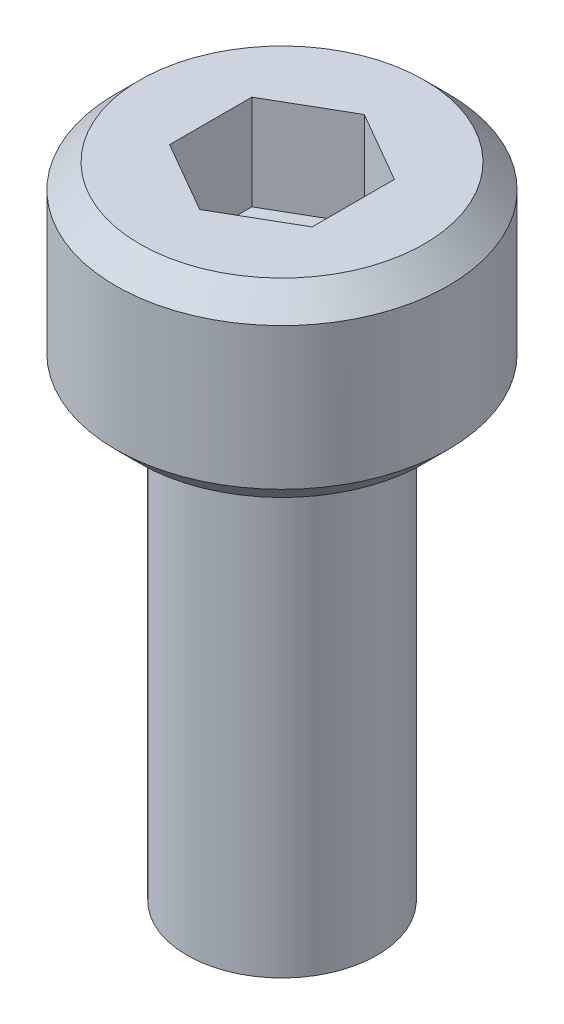
ISO-10303-21;
HEADER;
FILE_DESCRIPTION(('STEP AP214'),'2;1');
FILE_NAME('part.step','',(''),(''),'','','');
FILE_SCHEMA(('AUTOMOTIVE_DESIGN { 1 0 10303 214 1 1 1 1 }'));
ENDSEC;
DATA;
#1=APPLICATION_CONTEXT('core data for automotive mechanical design processes');
#2=APPLICATION_PROTOCOL_DEFINITION('international standard','automotive_design',2000,#1);
#3=PRODUCT_CONTEXT('',#1,'mechanical');
#4=PRODUCT('Part','Part','',(#3));
#5=PRODUCT_RELATED_PRODUCT_CATEGORY('part','',(#4));
#6=PRODUCT_DEFINITION_FORMATION('','',#4);
#7=PRODUCT_DEFINITION_CONTEXT('part definition',#1,'design');
#8=PRODUCT_DEFINITION('design','',#6,#7);
#9=PRODUCT_DEFINITION_SHAPE('','',#8);
#10=(LENGTH_UNIT() NAMED_UNIT(*) SI_UNIT(.MILLI.,.METRE.));
#11=(NAMED_UNIT(*) PLANE_ANGLE_UNIT() SI_UNIT($,.RADIAN.));
#12=(NAMED_UNIT(*) SI_UNIT($,.STERADIAN.) SOLID_ANGLE_UNIT());
#13=UNCERTAINTY_MEASURE_WITH_UNIT(LENGTH_MEASURE(1.E-05),#10,'distance_accuracy_value','');
#14=(GEOMETRIC_REPRESENTATION_CONTEXT(3) GLOBAL_UNCERTAINTY_ASSIGNED_CONTEXT((#13)) GLOBAL_UNIT_ASSIGNED_CONTEXT((#10,
#11,#12)) REPRESENTATION_CONTEXT('',''));
#15=CARTESIAN_POINT('',(0.,0.,0.));
#16=DIRECTION('',(0.,0.,1.));
#17=DIRECTION('',(1.,0.,0.));
#18=AXIS2_PLACEMENT_3D('',#15,#16,#17);
#19=CARTESIAN_POINT('',(0.,1.99999199999999,-1.73205080756887));
#20=DIRECTION('',(-0.5,0.,-0.866025403784439));
#21=DIRECTION('',(-0.866025403784439,0.,0.5));
#22=AXIS2_PLACEMENT_3D('',#19,#20,#21);
#23=PLANE('',#22);
#24=DIRECTION('',(0.,-1.,0.));
#25=VECTOR('',#24,1.);
#26=CARTESIAN_POINT('',(-1.49999999999999,1.99999199999999,-0.866025403784432));
#27=LINE('',#26,#25);
#28=CARTESIAN_POINT('',(-1.49999999999999,3.99999199999999,-0.866025403784429));
#29=VERTEX_POINT('',#28);
#30=CARTESIAN_POINT('',(-1.49999999999999,1.99999199999999,-0.866025403784429));
#31=VERTEX_POINT('',#30);
#32=EDGE_CURVE('E98',#29,#31,#27,.T.);
#33=ORIENTED_EDGE('',*,*,#32,.T.);
#34=DIRECTION('',(-0.866025403784439,0.,0.5));
#35=VECTOR('',#34,1.);
#36=CARTESIAN_POINT('',(0.,1.99999199999999,-1.73205080756887));
#37=LINE('',#36,#35);
#38=CARTESIAN_POINT('',(0.,1.999992,-1.73205080756887));
#39=VERTEX_POINT('',#38);
#40=EDGE_CURVE('E86',#39,#31,#37,.T.);
#41=ORIENTED_EDGE('',*,*,#40,.F.);
#42=DIRECTION('',(0.,1.,0.));
#43=VECTOR('',#42,1.);
#44=CARTESIAN_POINT('',(0.,1.99999200000003,-1.73205080756886));
#45=LINE('',#44,#43);
#46=CARTESIAN_POINT('',(0.,3.99999200000001,-1.73205080756887));
#47=VERTEX_POINT('',#46);
#48=EDGE_CURVE('E112',#39,#47,#45,.T.);
#49=ORIENTED_EDGE('',*,*,#48,.T.);
#50=DIRECTION('',(-0.866025403784439,0.,0.5));
#51=VECTOR('',#50,1.);
#52=CARTESIAN_POINT('',(0.,3.99999199999999,-1.73205080756887));
#53=LINE('',#52,#51);
#54=EDGE_CURVE('E80',#29,#47,#53,.F.);
#55=ORIENTED_EDGE('',*,*,#54,.F.);
#56=EDGE_LOOP('',(#33,#41,#49,#55));
#57=FACE_BOUND('',#56,.T.);
#58=ADVANCED_FACE('F17',(#57),#23,.F.);
#59=CARTESIAN_POINT('',(-1.49999999999999,1.99999199999999,-0.866025403784432));
#60=DIRECTION('',(-1.,0.,0.));
#61=DIRECTION('',(0.,-1.,0.));
#62=AXIS2_PLACEMENT_3D('',#59,#60,#61);
#63=PLANE('',#62);
#64=DIRECTION('',(0.,1.,0.));
#65=VECTOR('',#64,1.);
#66=CARTESIAN_POINT('',(-1.49999999999999,1.99999199999999,0.866025403784441));
#67=LINE('',#66,#65);
#68=CARTESIAN_POINT('',(-1.49999999999999,3.99999199999999,0.866025403784443));
#69=VERTEX_POINT('',#68);
#70=CARTESIAN_POINT('',(-1.49999999999999,1.99999199999999,0.866025403784439));
#71=VERTEX_POINT('',#70);
#72=EDGE_CURVE('E104',#69,#71,#67,.F.);
#73=ORIENTED_EDGE('',*,*,#72,.T.);
#74=DIRECTION('',(0.,0.,1.));
#75=VECTOR('',#74,1.);
#76=CARTESIAN_POINT('',(-1.49999999999999,1.99999199999999,-0.866025403784432));
#77=LINE('',#76,#75);
#78=EDGE_CURVE('E90',#31,#71,#77,.T.);
#79=ORIENTED_EDGE('',*,*,#78,.F.);
#80=ORIENTED_EDGE('',*,*,#32,.F.);
#81=DIRECTION('',(0.,0.,1.));
#82=VECTOR('',#81,1.);
#83=CARTESIAN_POINT('',(-1.49999999999999,3.99999199999999,-0.866025403784432));
#84=LINE('',#83,#82);
#85=EDGE_CURVE('E107',#69,#29,#84,.F.);
#86=ORIENTED_EDGE('',*,*,#85,.F.);
#87=EDGE_LOOP('',(#73,#79,#80,#86));
#88=FACE_BOUND('',#87,.T.);
#89=ADVANCED_FACE('F102',(#88),#63,.F.);
#90=CARTESIAN_POINT('',(1.50000000000001,1.99999200000003,-0.866025403784422));
#91=DIRECTION('',(0.5,0.,-0.866025403784439));
#92=DIRECTION('',(-0.866025403784439,0.,-0.5));
#93=AXIS2_PLACEMENT_3D('',#90,#91,#92);
#94=PLANE('',#93);
#95=ORIENTED_EDGE('',*,*,#48,.F.);
#96=DIRECTION('',(-0.866025403784436,0.,-0.500000000000005));
#97=VECTOR('',#96,1.);
#98=CARTESIAN_POINT('',(1.50000000000001,1.99999199999999,-0.866025403784422));
#99=LINE('',#98,#97);
#100=CARTESIAN_POINT('',(1.5,1.999992,-0.866025403784425));
#101=VERTEX_POINT('',#100);
#102=EDGE_CURVE('E93',#101,#39,#99,.T.);
#103=ORIENTED_EDGE('',*,*,#102,.F.);
#104=DIRECTION('',(0.,1.,0.));
#105=VECTOR('',#104,1.);
#106=CARTESIAN_POINT('',(1.5,1.99999199999999,-0.866025403784422));
#107=LINE('',#106,#105);
#108=CARTESIAN_POINT('',(1.5,3.99999200000002,-0.866025403784425));
#109=VERTEX_POINT('',#108);
#110=EDGE_CURVE('E154',#101,#109,#107,.T.);
#111=ORIENTED_EDGE('',*,*,#110,.T.);
#112=DIRECTION('',(-0.866025403784439,0.,-0.5));
#113=VECTOR('',#112,1.);
#114=CARTESIAN_POINT('',(1.50000000000001,3.99999200000005,-0.866025403784422));
#115=LINE('',#114,#113);
#116=EDGE_CURVE('E171',#47,#109,#115,.F.);
#117=ORIENTED_EDGE('',*,*,#116,.F.);
#118=EDGE_LOOP('',(#95,#103,#111,#117));
#119=FACE_BOUND('',#118,.T.);
#120=ADVANCED_FACE('F176',(#119),#94,.F.);
#121=CARTESIAN_POINT('',(-1.49999999999999,1.99999199999999,0.866025403784439));
#122=DIRECTION('',(-0.5,0.,0.866025403784439));
#123=DIRECTION('',(0.866025403784439,0.,0.5));
#124=AXIS2_PLACEMENT_3D('',#121,#122,#123);
#125=PLANE('',#124);
#126=DIRECTION('',(0.,1.,0.));
#127=VECTOR('',#126,1.);
#128=CARTESIAN_POINT('',(0.,1.99999199999999,1.73205080756887));
#129=LINE('',#128,#127);
#130=CARTESIAN_POINT('',(0.,3.99999199999999,1.73205080756888));
#131=VERTEX_POINT('',#130);
#132=CARTESIAN_POINT('',(0.,1.99999199999999,1.73205080756887));
#133=VERTEX_POINT('',#132);
#134=EDGE_CURVE('E149',#131,#133,#129,.F.);
#135=ORIENTED_EDGE('',*,*,#134,.T.);
#136=DIRECTION('',(0.86602540378444,0.,0.499999999999998));
#137=VECTOR('',#136,1.);
#138=CARTESIAN_POINT('',(-1.49999999999999,1.99999199999999,0.866025403784439));
#139=LINE('',#138,#137);
#140=EDGE_CURVE('E163',#71,#133,#139,.T.);
#141=ORIENTED_EDGE('',*,*,#140,.F.);
#142=ORIENTED_EDGE('',*,*,#72,.F.);
#143=DIRECTION('',(0.866025403784439,0.,0.5));
#144=VECTOR('',#143,1.);
#145=CARTESIAN_POINT('',(-1.49999999999999,3.99999199999999,0.866025403784439));
#146=LINE('',#145,#144);
#147=EDGE_CURVE('E166',#131,#69,#146,.F.);
#148=ORIENTED_EDGE('',*,*,#147,.F.);
#149=EDGE_LOOP('',(#135,#141,#142,#148));
#150=FACE_BOUND('',#149,.T.);
#151=ADVANCED_FACE('F183',(#150),#125,.F.);
#152=CARTESIAN_POINT('',(1.5,1.99999199999999,2.5980762113533));
#153=DIRECTION('',(0.,1.,0.));
#154=DIRECTION('',(0.,0.,1.));
#155=AXIS2_PLACEMENT_3D('',#152,#153,#154);
#156=PLANE('',#155);
#157=ORIENTED_EDGE('',*,*,#40,.T.);
#158=ORIENTED_EDGE('',*,*,#78,.T.);
#159=ORIENTED_EDGE('',*,*,#140,.T.);
#160=DIRECTION('',(0.866025403784439,0.,-0.5));
#161=VECTOR('',#160,1.);
#162=CARTESIAN_POINT('',(0.,1.99999199999999,1.73205080756887));
#163=LINE('',#162,#161);
#164=CARTESIAN_POINT('',(1.5,1.99999199999999,0.866025403784437));
#165=VERTEX_POINT('',#164);
#166=EDGE_CURVE('E146',#133,#165,#163,.T.);
#167=ORIENTED_EDGE('',*,*,#166,.T.);
#168=DIRECTION('',(0.,0.,1.));
#169=VECTOR('',#168,1.);
#170=CARTESIAN_POINT('',(1.5,1.99999199999999,0.866025403784439));
#171=LINE('',#170,#169);
#172=EDGE_CURVE('E158',#165,#101,#171,.F.);
#173=ORIENTED_EDGE('',*,*,#172,.T.);
#174=ORIENTED_EDGE('',*,*,#102,.T.);
#175=EDGE_LOOP('',(#157,#158,#159,#167,#173,#174));
#176=FACE_BOUND('',#175,.T.);
#177=ADVANCED_FACE('F87',(#176),#156,.T.);
#178=CARTESIAN_POINT('',(1.5,1.99999199999999,0.866025403784439));
#179=DIRECTION('',(1.,0.,0.));
#180=DIRECTION('',(0.,1.,0.));
#181=AXIS2_PLACEMENT_3D('',#178,#179,#180);
#182=PLANE('',#181);
#183=ORIENTED_EDGE('',*,*,#110,.F.);
#184=ORIENTED_EDGE('',*,*,#172,.F.);
#185=DIRECTION('',(0.,1.,0.));
#186=VECTOR('',#185,1.);
#187=CARTESIAN_POINT('',(1.5,1.99999199999999,0.866025403784431));
#188=LINE('',#187,#186);
#189=CARTESIAN_POINT('',(1.5,3.99999199999999,0.866025403784437));
#190=VERTEX_POINT('',#189);
#191=EDGE_CURVE('E143',#165,#190,#188,.T.);
#192=ORIENTED_EDGE('',*,*,#191,.T.);
#193=DIRECTION('',(0.,0.,1.));
#194=VECTOR('',#193,1.);
#195=CARTESIAN_POINT('',(1.5,3.99999199999999,0.866025403784439));
#196=LINE('',#195,#194);
#197=EDGE_CURVE('E40',#109,#190,#196,.T.);
#198=ORIENTED_EDGE('',*,*,#197,.F.);
#199=EDGE_LOOP('',(#183,#184,#192,#198));
#200=FACE_BOUND('',#199,.T.);
#201=ADVANCED_FACE('F190',(#200),#182,.F.);
#202=CARTESIAN_POINT('',(0.,1.99999199999999,1.73205080756887));
#203=DIRECTION('',(0.5,0.,0.866025403784439));
#204=DIRECTION('',(0.866025403784439,0.,-0.5));
#205=AXIS2_PLACEMENT_3D('',#202,#203,#204);
#206=PLANE('',#205);
#207=ORIENTED_EDGE('',*,*,#191,.F.);
#208=ORIENTED_EDGE('',*,*,#166,.F.);
#209=ORIENTED_EDGE('',*,*,#134,.F.);
#210=DIRECTION('',(-0.866025403784435,0.,0.500000000000006));
#211=VECTOR('',#210,1.);
#212=CARTESIAN_POINT('',(1.5,3.99999199999999,0.866025403784439));
#213=LINE('',#212,#211);
#214=EDGE_CURVE('E141',#190,#131,#213,.T.);
#215=ORIENTED_EDGE('',*,*,#214,.F.);
#216=EDGE_LOOP('',(#207,#208,#209,#215));
#217=FACE_BOUND('',#216,.T.);
#218=ADVANCED_FACE('F188',(#217),#206,.F.);
#219=CARTESIAN_POINT('',(0.,3.99999199999999,0.));
#220=DIRECTION('',(0.,1.,0.));
#221=DIRECTION('',(0.,0.,1.));
#222=AXIS2_PLACEMENT_3D('',#219,#220,#221);
#223=PLANE('',#222);
#224=ORIENTED_EDGE('',*,*,#197,.T.);
#225=ORIENTED_EDGE('',*,*,#214,.T.);
#226=ORIENTED_EDGE('',*,*,#147,.T.);
#227=ORIENTED_EDGE('',*,*,#85,.T.);
#228=ORIENTED_EDGE('',*,*,#54,.T.);
#229=ORIENTED_EDGE('',*,*,#116,.T.);
#230=EDGE_LOOP('',(#224,#225,#226,#227,#228,#229));
#231=FACE_BOUND('',#230,.T.);
#232=CARTESIAN_POINT('',(0.,3.99999199993317,0.));
#233=DIRECTION('',(0.,-1.,0.));
#234=DIRECTION('',(0.,0.,-1.));
#235=AXIS2_PLACEMENT_3D('',#232,#233,#234);
#236=CIRCLE('',#235,2.9920000000061);
#237=CARTESIAN_POINT('',(0.,3.99999199993317,-2.9920000000061));
#238=VERTEX_POINT('',#237);
#239=EDGE_CURVE('E20',#238,#238,#236,.T.);
#240=ORIENTED_EDGE('',*,*,#239,.F.);
#241=EDGE_LOOP('',(#240));
#242=FACE_BOUND('',#241,.T.);
#243=ADVANCED_FACE('F178',(#231,#242),#223,.T.);
#244=CARTESIAN_POINT('',(0.,3.49199200013572,0.));
#245=DIRECTION('',(0.,-1.,0.));
#246=DIRECTION('',(0.,0.,-1.));
#247=AXIS2_PLACEMENT_3D('',#244,#245,#246);
#248=CONICAL_SURFACE('',#247,3.49999999980355,0.785398163397448);
#249=ORIENTED_EDGE('',*,*,#239,.T.);
#250=EDGE_LOOP('',(#249));
#251=FACE_BOUND('',#250,.T.);
#252=CARTESIAN_POINT('',(0.,3.491992,0.));
#253=DIRECTION('',(0.,-1.,0.));
#254=DIRECTION('',(0.,0.,-1.));
#255=AXIS2_PLACEMENT_3D('',#252,#253,#254);
#256=CIRCLE('',#255,3.5);
#257=CARTESIAN_POINT('',(0.,3.491992,-3.5));
#258=VERTEX_POINT('',#257);
#259=EDGE_CURVE('E130',#258,#258,#256,.T.);
#260=ORIENTED_EDGE('',*,*,#259,.F.);
#261=EDGE_LOOP('',(#260));
#262=FACE_BOUND('',#261,.T.);
#263=ADVANCED_FACE('F227',(#251,#262),#248,.T.);
#264=CARTESIAN_POINT('',(0.,3.99999199999999,0.));
#265=DIRECTION('',(0.,-1.,0.));
#266=DIRECTION('',(0.,0.,-1.));
#267=AXIS2_PLACEMENT_3D('',#264,#265,#266);
#268=CYLINDRICAL_SURFACE('',#267,3.5);
#269=ORIENTED_EDGE('',*,*,#259,.T.);
#270=EDGE_LOOP('',(#269));
#271=FACE_BOUND('',#270,.T.);
#272=CARTESIAN_POINT('',(0.,0.507999999967979,0.));
#273=DIRECTION('',(0.,1.,0.));
#274=DIRECTION('',(0.,0.,1.));
#275=AXIS2_PLACEMENT_3D('',#272,#273,#274);
#276=CIRCLE('',#275,3.49999999997408);
#277=CARTESIAN_POINT('',(0.,0.507999999967979,3.49999999997408));
#278=VERTEX_POINT('',#277);
#279=EDGE_CURVE('E124',#278,#278,#276,.F.);
#280=ORIENTED_EDGE('',*,*,#279,.F.);
#281=EDGE_LOOP('',(#280));
#282=FACE_BOUND('',#281,.T.);
#283=ADVANCED_FACE('F223',(#271,#282),#268,.T.);
#284=CARTESIAN_POINT('',(0.,-10.,0.));
#285=DIRECTION('',(0.,1.,0.));
#286=DIRECTION('',(0.,0.,1.));
#287=AXIS2_PLACEMENT_3D('',#284,#285,#286);
#288=PLANE('',#287);
#289=CARTESIAN_POINT('',(0.,-10.000000000008,0.));
#290=DIRECTION('',(0.,1.,0.));
#291=DIRECTION('',(0.,0.,1.));
#292=AXIS2_PLACEMENT_3D('',#289,#290,#291);
#293=CIRCLE('',#292,1.23037999998133);
#294=CARTESIAN_POINT('',(0.,-10.000000000008,1.23037999998132));
#295=VERTEX_POINT('',#294);
#296=EDGE_CURVE('E121',#295,#295,#293,.T.);
#297=ORIENTED_EDGE('',*,*,#296,.F.);
#298=EDGE_LOOP('',(#297));
#299=FACE_BOUND('',#298,.T.);
#300=ADVANCED_FACE('F219',(#299),#288,.F.);
#301=CARTESIAN_POINT('',(0.,0.508000000024822,0.));
#302=DIRECTION('',(0.,1.,0.));
#303=DIRECTION('',(0.,0.,1.));
#304=AXIS2_PLACEMENT_3D('',#301,#302,#303);
#305=CONICAL_SURFACE('',#304,3.50000000008777,0.785398163453397);
#306=CARTESIAN_POINT('',(0.,0.,0.));
#307=DIRECTION('',(0.,1.,0.));
#308=DIRECTION('',(0.,0.,1.));
#309=AXIS2_PLACEMENT_3D('',#306,#307,#308);
#310=CIRCLE('',#309,2.9920000000061);
#311=CARTESIAN_POINT('',(0.,0.,2.9920000000061));
#312=VERTEX_POINT('',#311);
#313=EDGE_CURVE('E118',#312,#312,#310,.T.);
#314=ORIENTED_EDGE('',*,*,#313,.T.);
#315=EDGE_LOOP('',(#314));
#316=FACE_BOUND('',#315,.T.);
#317=ORIENTED_EDGE('',*,*,#279,.T.);
#318=EDGE_LOOP('',(#317));
#319=FACE_BOUND('',#318,.T.);
#320=ADVANCED_FACE('F215',(#316,#319),#305,.T.);
#321=CARTESIAN_POINT('',(0.,-9.46152000000211,0.));
#322=DIRECTION('',(0.,1.,0.));
#323=DIRECTION('',(0.,0.,1.));
#324=AXIS2_PLACEMENT_3D('',#321,#322,#323);
#325=CONICAL_SURFACE('',#324,1.99999999989587,0.960291895353206);
#326=CARTESIAN_POINT('',(0.,-9.46152,0.));
#327=DIRECTION('',(0.,1.,0.));
#328=DIRECTION('',(0.,0.,1.));
#329=AXIS2_PLACEMENT_3D('',#326,#327,#328);
#330=CIRCLE('',#329,2.);
#331=CARTESIAN_POINT('',(0.,-9.46152,1.99999999999999));
#332=VERTEX_POINT('',#331);
#333=EDGE_CURVE('E27',#332,#332,#330,.T.);
#334=ORIENTED_EDGE('',*,*,#333,.F.);
#335=EDGE_LOOP('',(#334));
#336=FACE_BOUND('',#335,.T.);
#337=ORIENTED_EDGE('',*,*,#296,.T.);
#338=EDGE_LOOP('',(#337));
#339=FACE_BOUND('',#338,.T.);
#340=ADVANCED_FACE('F208',(#336,#339),#325,.T.);
#341=CARTESIAN_POINT('',(0.,0.,0.));
#342=DIRECTION('',(0.,1.,0.));
#343=DIRECTION('',(0.,0.,1.));
#344=AXIS2_PLACEMENT_3D('',#341,#342,#343);
#345=PLANE('',#344);
#346=CARTESIAN_POINT('',(0.,0.,0.));
#347=DIRECTION('',(0.,1.,0.));
#348=DIRECTION('',(0.,0.,1.));
#349=AXIS2_PLACEMENT_3D('',#346,#347,#348);
#350=CIRCLE('',#349,2.);
#351=CARTESIAN_POINT('',(0.,0.,1.99999999999999));
#352=VERTEX_POINT('',#351);
#353=EDGE_CURVE('E11',#352,#352,#350,.F.);
#354=ORIENTED_EDGE('',*,*,#353,.F.);
#355=EDGE_LOOP('',(#354));
#356=FACE_BOUND('',#355,.T.);
#357=ORIENTED_EDGE('',*,*,#313,.F.);
#358=EDGE_LOOP('',(#357));
#359=FACE_BOUND('',#358,.T.);
#360=ADVANCED_FACE('F202',(#356,#359),#345,.F.);
#361=CARTESIAN_POINT('',(0.,-10.,0.));
#362=DIRECTION('',(0.,1.,0.));
#363=DIRECTION('',(0.,0.,1.));
#364=AXIS2_PLACEMENT_3D('',#361,#362,#363);
#365=CYLINDRICAL_SURFACE('',#364,2.);
#366=ORIENTED_EDGE('',*,*,#353,.T.);
#367=EDGE_LOOP('',(#366));
#368=FACE_BOUND('',#367,.T.);
#369=ORIENTED_EDGE('',*,*,#333,.T.);
#370=EDGE_LOOP('',(#369));
#371=FACE_BOUND('',#370,.T.);
#372=ADVANCED_FACE('F200',(#368,#371),#365,.T.);
#373=CLOSED_SHELL('',(#58,#89,#120,#151,#177,#201,#218,#243,#263,#283,#300,#320,#340,#360,#372));
#374=MANIFOLD_SOLID_BREP('B1',#373);
#375=ADVANCED_BREP_SHAPE_REPRESENTATION('',(#18,#374),#14);
#376=SHAPE_DEFINITION_REPRESENTATION(#9,#375);
ENDSEC;
END-ISO-10303-21;
